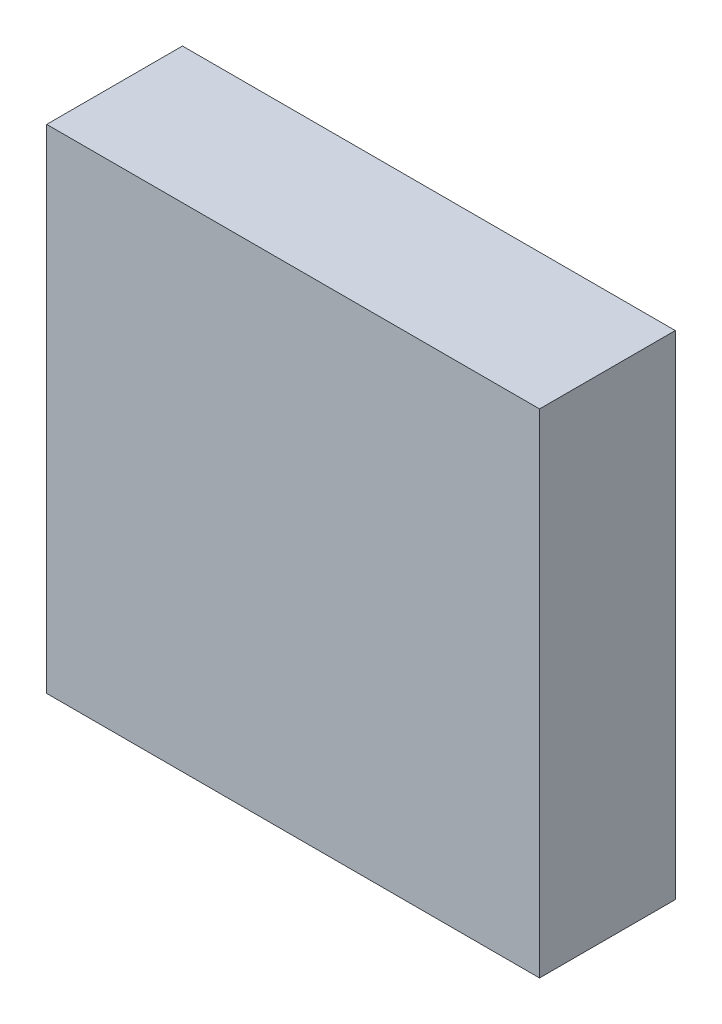
ISO-10303-21;
HEADER;
FILE_DESCRIPTION(('STEP AP214'),'2;1');
FILE_NAME('part.step','',(''),(''),'','','');
FILE_SCHEMA(('AUTOMOTIVE_DESIGN { 1 0 10303 214 1 1 1 1 }'));
ENDSEC;
DATA;
#1=APPLICATION_CONTEXT('core data for automotive mechanical design processes');
#2=APPLICATION_PROTOCOL_DEFINITION('international standard','automotive_design',2000,#1);
#3=PRODUCT_CONTEXT('',#1,'mechanical');
#4=PRODUCT('Part','Part','',(#3));
#5=PRODUCT_RELATED_PRODUCT_CATEGORY('part','',(#4));
#6=PRODUCT_DEFINITION_FORMATION('','',#4);
#7=PRODUCT_DEFINITION_CONTEXT('part definition',#1,'design');
#8=PRODUCT_DEFINITION('design','',#6,#7);
#9=PRODUCT_DEFINITION_SHAPE('','',#8);
#10=(LENGTH_UNIT() NAMED_UNIT(*) SI_UNIT(.MILLI.,.METRE.));
#11=(NAMED_UNIT(*) PLANE_ANGLE_UNIT() SI_UNIT($,.RADIAN.));
#12=(NAMED_UNIT(*) SI_UNIT($,.STERADIAN.) SOLID_ANGLE_UNIT());
#13=UNCERTAINTY_MEASURE_WITH_UNIT(LENGTH_MEASURE(1.E-05),#10,'distance_accuracy_value','');
#14=(GEOMETRIC_REPRESENTATION_CONTEXT(3) GLOBAL_UNCERTAINTY_ASSIGNED_CONTEXT((#13)) GLOBAL_UNIT_ASSIGNED_CONTEXT((#10,
#11,#12)) REPRESENTATION_CONTEXT('',''));
#15=CARTESIAN_POINT('',(0.,0.,0.));
#16=DIRECTION('',(0.,0.,1.));
#17=DIRECTION('',(1.,0.,0.));
#18=AXIS2_PLACEMENT_3D('',#15,#16,#17);
#19=CARTESIAN_POINT('',(0.,0.,0.));
#20=DIRECTION('',(0.,0.,1.));
#21=DIRECTION('',(1.,0.,0.));
#22=AXIS2_PLACEMENT_3D('',#19,#20,#21);
#23=PLANE('',#22);
#24=DIRECTION('',(0.,1.,0.));
#25=VECTOR('',#24,1.);
#26=CARTESIAN_POINT('',(79.,77.5,0.));
#27=LINE('',#26,#25);
#28=CARTESIAN_POINT('',(79.,-1.49999999999999,0.));
#29=VERTEX_POINT('',#28);
#30=CARTESIAN_POINT('',(79.,79.,0.));
#31=VERTEX_POINT('',#30);
#32=EDGE_CURVE('E179',#29,#31,#27,.T.);
#33=ORIENTED_EDGE('',*,*,#32,.T.);
#34=DIRECTION('',(-1.,0.,0.));
#35=VECTOR('',#34,1.);
#36=CARTESIAN_POINT('',(0.,79.,0.));
#37=LINE('',#36,#35);
#38=CARTESIAN_POINT('',(-1.5,79.,0.));
#39=VERTEX_POINT('',#38);
#40=EDGE_CURVE('E185',#31,#39,#37,.T.);
#41=ORIENTED_EDGE('',*,*,#40,.T.);
#42=DIRECTION('',(0.,-1.,0.));
#43=VECTOR('',#42,1.);
#44=CARTESIAN_POINT('',(-1.49999999999999,0.,0.));
#45=LINE('',#44,#43);
#46=CARTESIAN_POINT('',(-1.49999999999999,-1.49999999999999,0.));
#47=VERTEX_POINT('',#46);
#48=EDGE_CURVE('E183',#39,#47,#45,.T.);
#49=ORIENTED_EDGE('',*,*,#48,.T.);
#50=DIRECTION('',(1.,0.,0.));
#51=VECTOR('',#50,1.);
#52=CARTESIAN_POINT('',(77.5,-1.49999999999999,0.));
#53=LINE('',#52,#51);
#54=EDGE_CURVE('E181',#47,#29,#53,.T.);
#55=ORIENTED_EDGE('',*,*,#54,.T.);
#56=EDGE_LOOP('',(#33,#41,#49,#55));
#57=FACE_BOUND('',#56,.T.);
#58=DIRECTION('',(0.,-1.,0.));
#59=VECTOR('',#58,1.);
#60=CARTESIAN_POINT('',(-3.00000000000001,80.5,0.));
#61=LINE('',#60,#59);
#62=CARTESIAN_POINT('',(-3.00000000000001,80.5,0.));
#63=VERTEX_POINT('',#62);
#64=CARTESIAN_POINT('',(-3.00000000000001,-3.,0.));
#65=VERTEX_POINT('',#64);
#66=EDGE_CURVE('E167',#63,#65,#61,.T.);
#67=ORIENTED_EDGE('',*,*,#66,.F.);
#68=DIRECTION('',(-1.,0.,0.));
#69=VECTOR('',#68,1.);
#70=CARTESIAN_POINT('',(-3.00000000000001,80.5,0.));
#71=LINE('',#70,#69);
#72=CARTESIAN_POINT('',(80.5,80.5,0.));
#73=VERTEX_POINT('',#72);
#74=EDGE_CURVE('E121',#73,#63,#71,.T.);
#75=ORIENTED_EDGE('',*,*,#74,.F.);
#76=DIRECTION('',(0.,1.,0.));
#77=VECTOR('',#76,1.);
#78=CARTESIAN_POINT('',(80.5,80.5,0.));
#79=LINE('',#78,#77);
#80=CARTESIAN_POINT('',(80.5,-3.,0.));
#81=VERTEX_POINT('',#80);
#82=EDGE_CURVE('E171',#81,#73,#79,.T.);
#83=ORIENTED_EDGE('',*,*,#82,.F.);
#84=DIRECTION('',(1.,0.,0.));
#85=VECTOR('',#84,1.);
#86=CARTESIAN_POINT('',(-3.00000000000001,-3.,0.));
#87=LINE('',#86,#85);
#88=EDGE_CURVE('E169',#65,#81,#87,.T.);
#89=ORIENTED_EDGE('',*,*,#88,.F.);
#90=EDGE_LOOP('',(#67,#75,#83,#89));
#91=FACE_BOUND('',#90,.T.);
#92=ADVANCED_FACE('F35',(#57,#91),#23,.F.);
#93=CARTESIAN_POINT('',(-3.00000000000001,80.5,20.));
#94=DIRECTION('',(1.,0.,0.));
#95=DIRECTION('',(0.,1.,0.));
#96=AXIS2_PLACEMENT_3D('',#93,#94,#95);
#97=PLANE('',#96);
#98=ORIENTED_EDGE('',*,*,#66,.T.);
#99=DIRECTION('',(0.,0.,-1.));
#100=VECTOR('',#99,1.);
#101=CARTESIAN_POINT('',(-3.00000000000001,-3.,20.));
#102=LINE('',#101,#100);
#103=CARTESIAN_POINT('',(-3.00000000000001,-3.,23.));
#104=VERTEX_POINT('',#103);
#105=EDGE_CURVE('E131',#104,#65,#102,.T.);
#106=ORIENTED_EDGE('',*,*,#105,.F.);
#107=DIRECTION('',(0.,-1.,0.));
#108=VECTOR('',#107,1.);
#109=CARTESIAN_POINT('',(-3.00000000000001,80.5,23.));
#110=LINE('',#109,#108);
#111=CARTESIAN_POINT('',(-3.00000000000001,80.5,23.));
#112=VERTEX_POINT('',#111);
#113=EDGE_CURVE('E128',#112,#104,#110,.T.);
#114=ORIENTED_EDGE('',*,*,#113,.F.);
#115=DIRECTION('',(0.,0.,-1.));
#116=VECTOR('',#115,1.);
#117=CARTESIAN_POINT('',(-3.00000000000001,80.5,20.));
#118=LINE('',#117,#116);
#119=EDGE_CURVE('E114',#112,#63,#118,.T.);
#120=ORIENTED_EDGE('',*,*,#119,.T.);
#121=EDGE_LOOP('',(#98,#106,#114,#120));
#122=FACE_BOUND('',#121,.T.);
#123=ADVANCED_FACE('F129',(#122),#97,.F.);
#124=CARTESIAN_POINT('',(-3.00000000000001,-3.,20.));
#125=DIRECTION('',(0.,1.,0.));
#126=DIRECTION('',(0.,0.,1.));
#127=AXIS2_PLACEMENT_3D('',#124,#125,#126);
#128=PLANE('',#127);
#129=ORIENTED_EDGE('',*,*,#88,.T.);
#130=DIRECTION('',(0.,0.,-1.));
#131=VECTOR('',#130,1.);
#132=CARTESIAN_POINT('',(80.5,-3.,20.));
#133=LINE('',#132,#131);
#134=CARTESIAN_POINT('',(80.5,-3.,23.));
#135=VERTEX_POINT('',#134);
#136=EDGE_CURVE('E175',#135,#81,#133,.T.);
#137=ORIENTED_EDGE('',*,*,#136,.F.);
#138=DIRECTION('',(1.,0.,0.));
#139=VECTOR('',#138,1.);
#140=CARTESIAN_POINT('',(-3.00000000000001,-3.,23.));
#141=LINE('',#140,#139);
#142=EDGE_CURVE('E135',#104,#135,#141,.T.);
#143=ORIENTED_EDGE('',*,*,#142,.F.);
#144=ORIENTED_EDGE('',*,*,#105,.T.);
#145=EDGE_LOOP('',(#129,#137,#143,#144));
#146=FACE_BOUND('',#145,.T.);
#147=ADVANCED_FACE('F228',(#146),#128,.F.);
#148=CARTESIAN_POINT('',(80.5,80.5,20.));
#149=DIRECTION('',(-1.,0.,0.));
#150=DIRECTION('',(0.,-1.,0.));
#151=AXIS2_PLACEMENT_3D('',#148,#149,#150);
#152=PLANE('',#151);
#153=ORIENTED_EDGE('',*,*,#82,.T.);
#154=DIRECTION('',(0.,0.,-1.));
#155=VECTOR('',#154,1.);
#156=CARTESIAN_POINT('',(80.5,80.5,20.));
#157=LINE('',#156,#155);
#158=CARTESIAN_POINT('',(80.5,80.5,23.));
#159=VERTEX_POINT('',#158);
#160=EDGE_CURVE('E125',#159,#73,#157,.T.);
#161=ORIENTED_EDGE('',*,*,#160,.F.);
#162=DIRECTION('',(0.,1.,0.));
#163=VECTOR('',#162,1.);
#164=CARTESIAN_POINT('',(80.5,-3.,23.));
#165=LINE('',#164,#163);
#166=EDGE_CURVE('E140',#135,#159,#165,.T.);
#167=ORIENTED_EDGE('',*,*,#166,.F.);
#168=ORIENTED_EDGE('',*,*,#136,.T.);
#169=EDGE_LOOP('',(#153,#161,#167,#168));
#170=FACE_BOUND('',#169,.T.);
#171=ADVANCED_FACE('F230',(#170),#152,.F.);
#172=CARTESIAN_POINT('',(-3.00000000000001,80.5,20.));
#173=DIRECTION('',(0.,-1.,0.));
#174=DIRECTION('',(0.,0.,-1.));
#175=AXIS2_PLACEMENT_3D('',#172,#173,#174);
#176=PLANE('',#175);
#177=ORIENTED_EDGE('',*,*,#74,.T.);
#178=ORIENTED_EDGE('',*,*,#119,.F.);
#179=DIRECTION('',(-1.,0.,0.));
#180=VECTOR('',#179,1.);
#181=CARTESIAN_POINT('',(80.5,80.5,23.));
#182=LINE('',#181,#180);
#183=EDGE_CURVE('E119',#159,#112,#182,.T.);
#184=ORIENTED_EDGE('',*,*,#183,.F.);
#185=ORIENTED_EDGE('',*,*,#160,.T.);
#186=EDGE_LOOP('',(#177,#178,#184,#185));
#187=FACE_BOUND('',#186,.T.);
#188=ADVANCED_FACE('F116',(#187),#176,.F.);
#189=CARTESIAN_POINT('',(0.,0.,20.));
#190=DIRECTION('',(1.,0.,0.));
#191=DIRECTION('',(0.,1.,0.));
#192=AXIS2_PLACEMENT_3D('',#189,#190,#191);
#193=PLANE('',#192);
#194=DIRECTION('',(0.,0.,-1.));
#195=VECTOR('',#194,1.);
#196=CARTESIAN_POINT('',(0.,0.,20.));
#197=LINE('',#196,#195);
#198=CARTESIAN_POINT('',(0.,0.,20.));
#199=VERTEX_POINT('',#198);
#200=CARTESIAN_POINT('',(0.,0.,1.49999999999999));
#201=VERTEX_POINT('',#200);
#202=EDGE_CURVE('E165',#199,#201,#197,.T.);
#203=ORIENTED_EDGE('',*,*,#202,.T.);
#204=DIRECTION('',(0.,1.,0.));
#205=VECTOR('',#204,1.);
#206=CARTESIAN_POINT('',(0.,77.5,1.49999999999999));
#207=LINE('',#206,#205);
#208=CARTESIAN_POINT('',(0.,77.5,1.49999999999999));
#209=VERTEX_POINT('',#208);
#210=EDGE_CURVE('E191',#201,#209,#207,.T.);
#211=ORIENTED_EDGE('',*,*,#210,.T.);
#212=DIRECTION('',(0.,0.,-1.));
#213=VECTOR('',#212,1.);
#214=CARTESIAN_POINT('',(0.,77.5,20.));
#215=LINE('',#214,#213);
#216=CARTESIAN_POINT('',(0.,77.5,20.));
#217=VERTEX_POINT('',#216);
#218=EDGE_CURVE('E158',#217,#209,#215,.T.);
#219=ORIENTED_EDGE('',*,*,#218,.F.);
#220=DIRECTION('',(0.,-1.,0.));
#221=VECTOR('',#220,1.);
#222=CARTESIAN_POINT('',(0.,0.,20.));
#223=LINE('',#222,#221);
#224=EDGE_CURVE('E146',#217,#199,#223,.T.);
#225=ORIENTED_EDGE('',*,*,#224,.T.);
#226=EDGE_LOOP('',(#203,#211,#219,#225));
#227=FACE_BOUND('',#226,.T.);
#228=ADVANCED_FACE('F214',(#227),#193,.T.);
#229=CARTESIAN_POINT('',(0.,0.,20.));
#230=DIRECTION('',(0.,1.,0.));
#231=DIRECTION('',(0.,0.,1.));
#232=AXIS2_PLACEMENT_3D('',#229,#230,#231);
#233=PLANE('',#232);
#234=DIRECTION('',(0.,0.,-1.));
#235=VECTOR('',#234,1.);
#236=CARTESIAN_POINT('',(77.5,0.,20.));
#237=LINE('',#236,#235);
#238=CARTESIAN_POINT('',(77.5,0.,20.));
#239=VERTEX_POINT('',#238);
#240=CARTESIAN_POINT('',(77.5,0.,1.49999999999999));
#241=VERTEX_POINT('',#240);
#242=EDGE_CURVE('E163',#239,#241,#237,.T.);
#243=ORIENTED_EDGE('',*,*,#242,.T.);
#244=DIRECTION('',(-1.,0.,0.));
#245=VECTOR('',#244,1.);
#246=CARTESIAN_POINT('',(0.,0.,1.49999999999999));
#247=LINE('',#246,#245);
#248=EDGE_CURVE('E44',#241,#201,#247,.T.);
#249=ORIENTED_EDGE('',*,*,#248,.T.);
#250=ORIENTED_EDGE('',*,*,#202,.F.);
#251=DIRECTION('',(1.,0.,0.));
#252=VECTOR('',#251,1.);
#253=CARTESIAN_POINT('',(0.,0.,20.));
#254=LINE('',#253,#252);
#255=EDGE_CURVE('E149',#199,#239,#254,.T.);
#256=ORIENTED_EDGE('',*,*,#255,.T.);
#257=EDGE_LOOP('',(#243,#249,#250,#256));
#258=FACE_BOUND('',#257,.T.);
#259=ADVANCED_FACE('F258',(#258),#233,.T.);
#260=CARTESIAN_POINT('',(77.5,0.,20.));
#261=DIRECTION('',(-1.,0.,0.));
#262=DIRECTION('',(0.,-1.,0.));
#263=AXIS2_PLACEMENT_3D('',#260,#261,#262);
#264=PLANE('',#263);
#265=DIRECTION('',(0.,0.,-1.));
#266=VECTOR('',#265,1.);
#267=CARTESIAN_POINT('',(77.5,77.5,20.));
#268=LINE('',#267,#266);
#269=CARTESIAN_POINT('',(77.5,77.5,20.));
#270=VERTEX_POINT('',#269);
#271=CARTESIAN_POINT('',(77.5,77.5,1.49999999999999));
#272=VERTEX_POINT('',#271);
#273=EDGE_CURVE('E161',#270,#272,#268,.T.);
#274=ORIENTED_EDGE('',*,*,#273,.T.);
#275=DIRECTION('',(0.,-1.,0.));
#276=VECTOR('',#275,1.);
#277=CARTESIAN_POINT('',(77.5,0.,1.49999999999999));
#278=LINE('',#277,#276);
#279=EDGE_CURVE('E11',#272,#241,#278,.T.);
#280=ORIENTED_EDGE('',*,*,#279,.T.);
#281=ORIENTED_EDGE('',*,*,#242,.F.);
#282=DIRECTION('',(0.,1.,0.));
#283=VECTOR('',#282,1.);
#284=CARTESIAN_POINT('',(77.5,0.,20.));
#285=LINE('',#284,#283);
#286=EDGE_CURVE('E152',#239,#270,#285,.T.);
#287=ORIENTED_EDGE('',*,*,#286,.T.);
#288=EDGE_LOOP('',(#274,#280,#281,#287));
#289=FACE_BOUND('',#288,.T.);
#290=ADVANCED_FACE('F253',(#289),#264,.T.);
#291=CARTESIAN_POINT('',(0.,77.5,20.));
#292=DIRECTION('',(0.,-1.,0.));
#293=DIRECTION('',(0.,0.,-1.));
#294=AXIS2_PLACEMENT_3D('',#291,#292,#293);
#295=PLANE('',#294);
#296=ORIENTED_EDGE('',*,*,#218,.T.);
#297=DIRECTION('',(1.,0.,0.));
#298=VECTOR('',#297,1.);
#299=CARTESIAN_POINT('',(77.5,77.5,1.49999999999999));
#300=LINE('',#299,#298);
#301=EDGE_CURVE('E188',#209,#272,#300,.T.);
#302=ORIENTED_EDGE('',*,*,#301,.T.);
#303=ORIENTED_EDGE('',*,*,#273,.F.);
#304=DIRECTION('',(-1.,0.,0.));
#305=VECTOR('',#304,1.);
#306=CARTESIAN_POINT('',(0.,77.5,20.));
#307=LINE('',#306,#305);
#308=EDGE_CURVE('E155',#270,#217,#307,.T.);
#309=ORIENTED_EDGE('',*,*,#308,.T.);
#310=EDGE_LOOP('',(#296,#302,#303,#309));
#311=FACE_BOUND('',#310,.T.);
#312=ADVANCED_FACE('F217',(#311),#295,.T.);
#313=CARTESIAN_POINT('',(0.,-1.49999999999999,0.));
#314=DIRECTION('',(0.,0.707106781186548,-0.707106781186548));
#315=DIRECTION('',(-1.,0.,0.));
#316=AXIS2_PLACEMENT_3D('',#313,#314,#315);
#317=PLANE('',#316);
#318=DIRECTION('',(0.577350269189626,0.577350269189626,0.577350269189626));
#319=VECTOR('',#318,1.);
#320=CARTESIAN_POINT('',(-0.999999999999992,-0.999999999999992,0.499999999999996));
#321=LINE('',#320,#319);
#322=EDGE_CURVE('E196',#201,#47,#321,.F.);
#323=ORIENTED_EDGE('',*,*,#322,.F.);
#324=ORIENTED_EDGE('',*,*,#248,.F.);
#325=DIRECTION('',(-0.577350269189626,0.577350269189626,0.577350269189626));
#326=VECTOR('',#325,1.);
#327=CARTESIAN_POINT('',(52.6666666666667,24.8333333333333,26.3333333333333));
#328=LINE('',#327,#326);
#329=EDGE_CURVE('E39',#29,#241,#328,.T.);
#330=ORIENTED_EDGE('',*,*,#329,.F.);
#331=ORIENTED_EDGE('',*,*,#54,.F.);
#332=EDGE_LOOP('',(#323,#324,#330,#331));
#333=FACE_BOUND('',#332,.T.);
#334=ADVANCED_FACE('F37',(#333),#317,.T.);
#335=CARTESIAN_POINT('',(79.,0.,0.));
#336=DIRECTION('',(-0.707106781186548,0.,-0.707106781186548));
#337=DIRECTION('',(0.,-1.,0.));
#338=AXIS2_PLACEMENT_3D('',#335,#336,#337);
#339=PLANE('',#338);
#340=ORIENTED_EDGE('',*,*,#329,.T.);
#341=ORIENTED_EDGE('',*,*,#279,.F.);
#342=DIRECTION('',(0.577350269189626,0.577350269189626,-0.577350269189626));
#343=VECTOR('',#342,1.);
#344=CARTESIAN_POINT('',(52.6666666666667,52.6666666666667,26.3333333333333));
#345=LINE('',#344,#343);
#346=EDGE_CURVE('E195',#31,#272,#345,.F.);
#347=ORIENTED_EDGE('',*,*,#346,.F.);
#348=ORIENTED_EDGE('',*,*,#32,.F.);
#349=EDGE_LOOP('',(#340,#341,#347,#348));
#350=FACE_BOUND('',#349,.T.);
#351=ADVANCED_FACE('F206',(#350),#339,.T.);
#352=CARTESIAN_POINT('',(-1.49999999999999,0.,0.));
#353=DIRECTION('',(0.707106781186548,0.,-0.707106781186548));
#354=DIRECTION('',(0.,1.,0.));
#355=AXIS2_PLACEMENT_3D('',#352,#353,#354);
#356=PLANE('',#355);
#357=ORIENTED_EDGE('',*,*,#322,.T.);
#358=ORIENTED_EDGE('',*,*,#48,.F.);
#359=DIRECTION('',(0.577350269189626,-0.577350269189626,0.577350269189626));
#360=VECTOR('',#359,1.);
#361=CARTESIAN_POINT('',(-1.,78.5,0.500000000000001));
#362=LINE('',#361,#360);
#363=EDGE_CURVE('E145',#209,#39,#362,.F.);
#364=ORIENTED_EDGE('',*,*,#363,.F.);
#365=ORIENTED_EDGE('',*,*,#210,.F.);
#366=EDGE_LOOP('',(#357,#358,#364,#365));
#367=FACE_BOUND('',#366,.T.);
#368=ADVANCED_FACE('F211',(#367),#356,.T.);
#369=CARTESIAN_POINT('',(0.,79.,0.));
#370=DIRECTION('',(0.,-0.707106781186548,-0.707106781186548));
#371=DIRECTION('',(1.,0.,0.));
#372=AXIS2_PLACEMENT_3D('',#369,#370,#371);
#373=PLANE('',#372);
#374=ORIENTED_EDGE('',*,*,#346,.T.);
#375=ORIENTED_EDGE('',*,*,#301,.F.);
#376=ORIENTED_EDGE('',*,*,#363,.T.);
#377=ORIENTED_EDGE('',*,*,#40,.F.);
#378=EDGE_LOOP('',(#374,#375,#376,#377));
#379=FACE_BOUND('',#378,.T.);
#380=ADVANCED_FACE('F220',(#379),#373,.T.);
#381=CARTESIAN_POINT('',(0.,0.,20.));
#382=DIRECTION('',(0.,0.,1.));
#383=DIRECTION('',(1.,0.,0.));
#384=AXIS2_PLACEMENT_3D('',#381,#382,#383);
#385=PLANE('',#384);
#386=ORIENTED_EDGE('',*,*,#224,.F.);
#387=ORIENTED_EDGE('',*,*,#308,.F.);
#388=ORIENTED_EDGE('',*,*,#286,.F.);
#389=ORIENTED_EDGE('',*,*,#255,.F.);
#390=EDGE_LOOP('',(#386,#387,#388,#389));
#391=FACE_BOUND('',#390,.T.);
#392=ADVANCED_FACE('F244',(#391),#385,.F.);
#393=CARTESIAN_POINT('',(0.,0.,23.));
#394=DIRECTION('',(0.,0.,1.));
#395=DIRECTION('',(1.,0.,0.));
#396=AXIS2_PLACEMENT_3D('',#393,#394,#395);
#397=PLANE('',#396);
#398=ORIENTED_EDGE('',*,*,#183,.T.);
#399=ORIENTED_EDGE('',*,*,#113,.T.);
#400=ORIENTED_EDGE('',*,*,#142,.T.);
#401=ORIENTED_EDGE('',*,*,#166,.T.);
#402=EDGE_LOOP('',(#398,#399,#400,#401));
#403=FACE_BOUND('',#402,.T.);
#404=ADVANCED_FACE('F138',(#403),#397,.T.);
#405=CLOSED_SHELL('',(#92,#123,#147,#171,#188,#228,#259,#290,#312,#334,#351,#368,#380,#392,#404));
#406=MANIFOLD_SOLID_BREP('B2',#405);
#407=ADVANCED_BREP_SHAPE_REPRESENTATION('',(#18,#406),#14);
#408=SHAPE_DEFINITION_REPRESENTATION(#9,#407);
ENDSEC;
END-ISO-10303-21;
